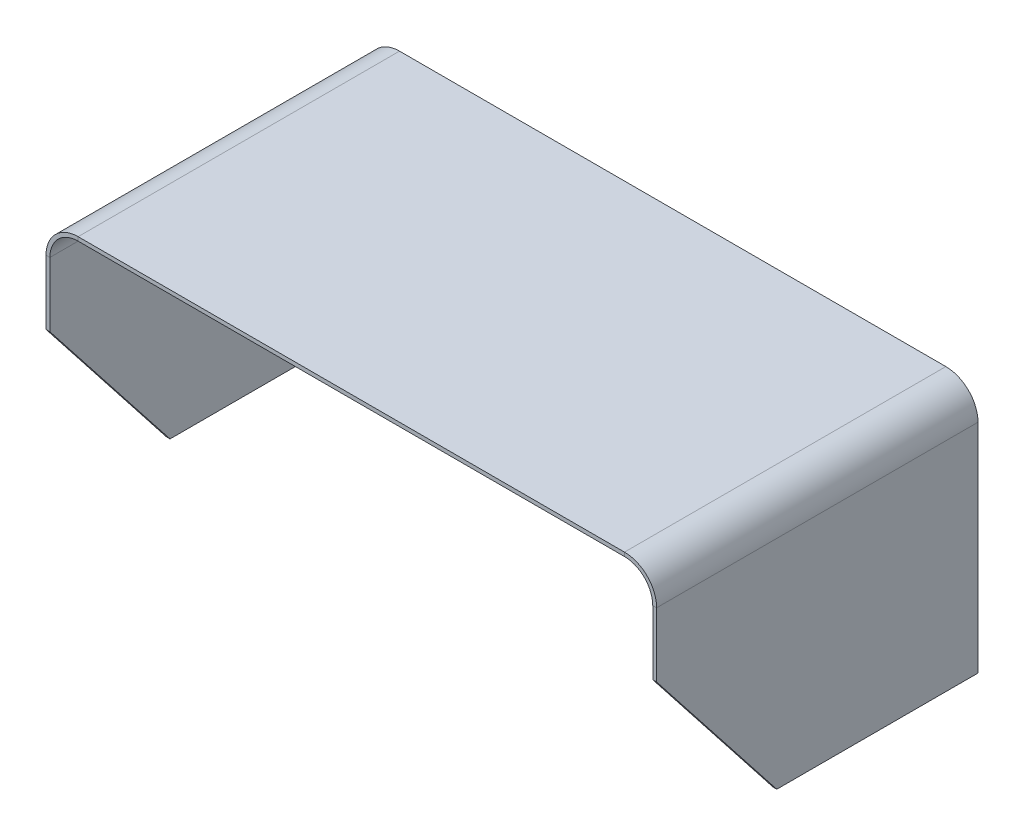
ISO-10303-21;
HEADER;
FILE_DESCRIPTION(('STEP AP214'),'2;1');
FILE_NAME('part.step','',(''),(''),'','','');
FILE_SCHEMA(('AUTOMOTIVE_DESIGN { 1 0 10303 214 1 1 1 1 }'));
ENDSEC;
DATA;
#1=APPLICATION_CONTEXT('core data for automotive mechanical design processes');
#2=APPLICATION_PROTOCOL_DEFINITION('international standard','automotive_design',2000,#1);
#3=PRODUCT_CONTEXT('',#1,'mechanical');
#4=PRODUCT('Part','Part','',(#3));
#5=PRODUCT_RELATED_PRODUCT_CATEGORY('part','',(#4));
#6=PRODUCT_DEFINITION_FORMATION('','',#4);
#7=PRODUCT_DEFINITION_CONTEXT('part definition',#1,'design');
#8=PRODUCT_DEFINITION('design','',#6,#7);
#9=PRODUCT_DEFINITION_SHAPE('','',#8);
#10=(LENGTH_UNIT() NAMED_UNIT(*) SI_UNIT(.MILLI.,.METRE.));
#11=(NAMED_UNIT(*) PLANE_ANGLE_UNIT() SI_UNIT($,.RADIAN.));
#12=(NAMED_UNIT(*) SI_UNIT($,.STERADIAN.) SOLID_ANGLE_UNIT());
#13=UNCERTAINTY_MEASURE_WITH_UNIT(LENGTH_MEASURE(1.E-05),#10,'distance_accuracy_value','');
#14=(GEOMETRIC_REPRESENTATION_CONTEXT(3) GLOBAL_UNCERTAINTY_ASSIGNED_CONTEXT((#13)) GLOBAL_UNIT_ASSIGNED_CONTEXT((#10,
#11,#12)) REPRESENTATION_CONTEXT('',''));
#15=CARTESIAN_POINT('',(0.,0.,0.));
#16=DIRECTION('',(0.,0.,1.));
#17=DIRECTION('',(1.,0.,0.));
#18=AXIS2_PLACEMENT_3D('',#15,#16,#17);
#19=CARTESIAN_POINT('',(53.975,18.288,31.75));
#20=DIRECTION('',(0.,0.,1.));
#21=DIRECTION('',(1.,0.,0.));
#22=AXIS2_PLACEMENT_3D('',#19,#20,#21);
#23=PLANE('',#22);
#24=DIRECTION('',(0.,1.,0.));
#25=VECTOR('',#24,1.);
#26=CARTESIAN_POINT('',(59.563,0.,31.75));
#27=LINE('',#26,#25);
#28=CARTESIAN_POINT('',(59.563,0.,31.75));
#29=VERTEX_POINT('',#28);
#30=CARTESIAN_POINT('',(59.563,12.7,31.75));
#31=VERTEX_POINT('',#30);
#32=EDGE_CURVE('E145',#29,#31,#27,.T.);
#33=ORIENTED_EDGE('',*,*,#32,.F.);
#34=DIRECTION('',(-1.,0.,0.));
#35=VECTOR('',#34,1.);
#36=CARTESIAN_POINT('',(59.563,0.,31.75));
#37=LINE('',#36,#35);
#38=CARTESIAN_POINT('',(60.325,0.,31.75));
#39=VERTEX_POINT('',#38);
#40=EDGE_CURVE('E133',#29,#39,#37,.F.);
#41=ORIENTED_EDGE('',*,*,#40,.T.);
#42=DIRECTION('',(0.,1.,0.));
#43=VECTOR('',#42,1.);
#44=CARTESIAN_POINT('',(60.325,0.,31.75));
#45=LINE('',#44,#43);
#46=CARTESIAN_POINT('',(60.325,12.7,31.75));
#47=VERTEX_POINT('',#46);
#48=EDGE_CURVE('E143',#39,#47,#45,.T.);
#49=ORIENTED_EDGE('',*,*,#48,.T.);
#50=DIRECTION('',(-1.,0.,0.));
#51=VECTOR('',#50,1.);
#52=CARTESIAN_POINT('',(60.325,12.7,31.75));
#53=LINE('',#52,#51);
#54=EDGE_CURVE('E240',#47,#31,#53,.T.);
#55=ORIENTED_EDGE('',*,*,#54,.T.);
#56=EDGE_LOOP('',(#33,#41,#49,#55));
#57=FACE_BOUND('',#56,.T.);
#58=ADVANCED_FACE('F33',(#57),#23,.T.);
#59=CARTESIAN_POINT('',(59.563,0.,31.75));
#60=DIRECTION('',(-1.,0.,0.));
#61=DIRECTION('',(0.,0.,1.));
#62=AXIS2_PLACEMENT_3D('',#59,#60,#61);
#63=PLANE('',#62);
#64=DIRECTION('',(0.,0.,-1.));
#65=VECTOR('',#64,1.);
#66=CARTESIAN_POINT('',(59.563,-30.226,31.75));
#67=LINE('',#66,#65);
#68=CARTESIAN_POINT('',(59.563,-30.226,8.00099999998738));
#69=VERTEX_POINT('',#68);
#70=CARTESIAN_POINT('',(59.563,-30.226,-31.75));
#71=VERTEX_POINT('',#70);
#72=EDGE_CURVE('E216',#69,#71,#67,.T.);
#73=ORIENTED_EDGE('',*,*,#72,.F.);
#74=DIRECTION('',(0.,-0.786318338822263,-0.617821551932106));
#75=VECTOR('',#74,1.);
#76=CARTESIAN_POINT('',(59.563,0.,31.75));
#77=LINE('',#76,#75);
#78=EDGE_CURVE('E138',#29,#69,#77,.T.);
#79=ORIENTED_EDGE('',*,*,#78,.F.);
#80=ORIENTED_EDGE('',*,*,#32,.T.);
#81=DIRECTION('',(0.,0.,-1.));
#82=VECTOR('',#81,1.);
#83=CARTESIAN_POINT('',(59.563,12.7,31.75));
#84=LINE('',#83,#82);
#85=CARTESIAN_POINT('',(59.563,12.7,-31.75));
#86=VERTEX_POINT('',#85);
#87=EDGE_CURVE('E218',#31,#86,#84,.T.);
#88=ORIENTED_EDGE('',*,*,#87,.T.);
#89=DIRECTION('',(0.,1.,0.));
#90=VECTOR('',#89,1.);
#91=CARTESIAN_POINT('',(59.563,0.,-31.75));
#92=LINE('',#91,#90);
#93=EDGE_CURVE('E184',#71,#86,#92,.T.);
#94=ORIENTED_EDGE('',*,*,#93,.F.);
#95=EDGE_LOOP('',(#73,#79,#80,#88,#94));
#96=FACE_BOUND('',#95,.T.);
#97=ADVANCED_FACE('F333',(#96),#63,.T.);
#98=CARTESIAN_POINT('',(60.325,-30.226,31.75));
#99=DIRECTION('',(0.,-1.,0.));
#100=DIRECTION('',(1.,0.,0.));
#101=AXIS2_PLACEMENT_3D('',#98,#99,#100);
#102=PLANE('',#101);
#103=DIRECTION('',(0.,0.,-1.));
#104=VECTOR('',#103,1.);
#105=CARTESIAN_POINT('',(60.325,-30.226,31.75));
#106=LINE('',#105,#104);
#107=CARTESIAN_POINT('',(60.325,-30.226,8.0009999999874));
#108=VERTEX_POINT('',#107);
#109=CARTESIAN_POINT('',(60.325,-30.226,-31.75));
#110=VERTEX_POINT('',#109);
#111=EDGE_CURVE('E214',#108,#110,#106,.T.);
#112=ORIENTED_EDGE('',*,*,#111,.F.);
#113=DIRECTION('',(-1.,0.,0.));
#114=VECTOR('',#113,1.);
#115=CARTESIAN_POINT('',(59.563,-30.226,8.00099999998738));
#116=LINE('',#115,#114);
#117=EDGE_CURVE('E48',#69,#108,#116,.F.);
#118=ORIENTED_EDGE('',*,*,#117,.F.);
#119=ORIENTED_EDGE('',*,*,#72,.T.);
#120=DIRECTION('',(-1.,0.,0.));
#121=VECTOR('',#120,1.);
#122=CARTESIAN_POINT('',(60.325,-30.226,-31.75));
#123=LINE('',#122,#121);
#124=EDGE_CURVE('E187',#110,#71,#123,.T.);
#125=ORIENTED_EDGE('',*,*,#124,.F.);
#126=EDGE_LOOP('',(#112,#118,#119,#125));
#127=FACE_BOUND('',#126,.T.);
#128=ADVANCED_FACE('F338',(#127),#102,.T.);
#129=CARTESIAN_POINT('',(60.325,0.,31.75));
#130=DIRECTION('',(-1.,0.,0.));
#131=DIRECTION('',(0.,-1.,0.));
#132=AXIS2_PLACEMENT_3D('',#129,#130,#131);
#133=PLANE('',#132);
#134=DIRECTION('',(0.,-0.786318338822263,-0.617821551932106));
#135=VECTOR('',#134,1.);
#136=CARTESIAN_POINT('',(60.325,0.,31.75));
#137=LINE('',#136,#135);
#138=EDGE_CURVE('E130',#39,#108,#137,.T.);
#139=ORIENTED_EDGE('',*,*,#138,.T.);
#140=ORIENTED_EDGE('',*,*,#111,.T.);
#141=DIRECTION('',(0.,1.,0.));
#142=VECTOR('',#141,1.);
#143=CARTESIAN_POINT('',(60.325,0.,-31.75));
#144=LINE('',#143,#142);
#145=CARTESIAN_POINT('',(60.325,12.7,-31.75));
#146=VERTEX_POINT('',#145);
#147=EDGE_CURVE('E190',#110,#146,#144,.T.);
#148=ORIENTED_EDGE('',*,*,#147,.T.);
#149=DIRECTION('',(0.,0.,-1.));
#150=VECTOR('',#149,1.);
#151=CARTESIAN_POINT('',(60.325,12.7,31.75));
#152=LINE('',#151,#150);
#153=EDGE_CURVE('E151',#47,#146,#152,.T.);
#154=ORIENTED_EDGE('',*,*,#153,.F.);
#155=ORIENTED_EDGE('',*,*,#48,.F.);
#156=EDGE_LOOP('',(#139,#140,#148,#154,#155));
#157=FACE_BOUND('',#156,.T.);
#158=ADVANCED_FACE('F148',(#157),#133,.F.);
#159=CARTESIAN_POINT('',(-59.563,-30.226,31.75));
#160=DIRECTION('',(0.,-1.,0.));
#161=DIRECTION('',(1.,0.,0.));
#162=AXIS2_PLACEMENT_3D('',#159,#160,#161);
#163=PLANE('',#162);
#164=DIRECTION('',(0.,0.,-1.));
#165=VECTOR('',#164,1.);
#166=CARTESIAN_POINT('',(-59.563,-30.226,31.75));
#167=LINE('',#166,#165);
#168=CARTESIAN_POINT('',(-59.563,-30.226,8.00099999998738));
#169=VERTEX_POINT('',#168);
#170=CARTESIAN_POINT('',(-59.563,-30.226,-31.75));
#171=VERTEX_POINT('',#170);
#172=EDGE_CURVE('E230',#169,#171,#167,.T.);
#173=ORIENTED_EDGE('',*,*,#172,.F.);
#174=DIRECTION('',(1.,0.,0.));
#175=VECTOR('',#174,1.);
#176=CARTESIAN_POINT('',(-59.563,-30.226,8.00099999998738));
#177=LINE('',#176,#175);
#178=CARTESIAN_POINT('',(-60.325,-30.226,8.00099999998738));
#179=VERTEX_POINT('',#178);
#180=EDGE_CURVE('E286',#169,#179,#177,.F.);
#181=ORIENTED_EDGE('',*,*,#180,.T.);
#182=DIRECTION('',(0.,0.,-1.));
#183=VECTOR('',#182,1.);
#184=CARTESIAN_POINT('',(-60.325,-30.226,31.75));
#185=LINE('',#184,#183);
#186=CARTESIAN_POINT('',(-60.325,-30.226,-31.75));
#187=VERTEX_POINT('',#186);
#188=EDGE_CURVE('E232',#179,#187,#185,.T.);
#189=ORIENTED_EDGE('',*,*,#188,.T.);
#190=DIRECTION('',(-1.,0.,0.));
#191=VECTOR('',#190,1.);
#192=CARTESIAN_POINT('',(-59.563,-30.226,-31.75));
#193=LINE('',#192,#191);
#194=EDGE_CURVE('E168',#171,#187,#193,.T.);
#195=ORIENTED_EDGE('',*,*,#194,.F.);
#196=EDGE_LOOP('',(#173,#181,#189,#195));
#197=FACE_BOUND('',#196,.T.);
#198=ADVANCED_FACE('F285',(#197),#163,.T.);
#199=CARTESIAN_POINT('',(-59.563,0.,31.75));
#200=DIRECTION('',(1.,0.,0.));
#201=DIRECTION('',(0.,0.,-1.));
#202=AXIS2_PLACEMENT_3D('',#199,#200,#201);
#203=PLANE('',#202);
#204=DIRECTION('',(0.,1.,0.));
#205=VECTOR('',#204,1.);
#206=CARTESIAN_POINT('',(-59.563,0.,31.75));
#207=LINE('',#206,#205);
#208=CARTESIAN_POINT('',(-59.563,12.7,31.75));
#209=VERTEX_POINT('',#208);
#210=CARTESIAN_POINT('',(-59.563,0.,31.75));
#211=VERTEX_POINT('',#210);
#212=EDGE_CURVE('E251',#209,#211,#207,.F.);
#213=ORIENTED_EDGE('',*,*,#212,.T.);
#214=DIRECTION('',(0.,0.786318338822263,0.617821551932106));
#215=VECTOR('',#214,1.);
#216=CARTESIAN_POINT('',(-59.563,0.,31.75));
#217=LINE('',#216,#215);
#218=EDGE_CURVE('E56',#169,#211,#217,.T.);
#219=ORIENTED_EDGE('',*,*,#218,.F.);
#220=ORIENTED_EDGE('',*,*,#172,.T.);
#221=DIRECTION('',(0.,1.,0.));
#222=VECTOR('',#221,1.);
#223=CARTESIAN_POINT('',(-59.563,0.,-31.75));
#224=LINE('',#223,#222);
#225=CARTESIAN_POINT('',(-59.563,12.7,-31.75));
#226=VERTEX_POINT('',#225);
#227=EDGE_CURVE('E171',#226,#171,#224,.F.);
#228=ORIENTED_EDGE('',*,*,#227,.F.);
#229=DIRECTION('',(0.,0.,-1.));
#230=VECTOR('',#229,1.);
#231=CARTESIAN_POINT('',(-59.563,12.7,31.75));
#232=LINE('',#231,#230);
#233=EDGE_CURVE('E227',#209,#226,#232,.T.);
#234=ORIENTED_EDGE('',*,*,#233,.F.);
#235=EDGE_LOOP('',(#213,#219,#220,#228,#234));
#236=FACE_BOUND('',#235,.T.);
#237=ADVANCED_FACE('F281',(#236),#203,.T.);
#238=CARTESIAN_POINT('',(-60.325,0.,31.75));
#239=DIRECTION('',(1.,0.,0.));
#240=DIRECTION('',(0.,0.,-1.));
#241=AXIS2_PLACEMENT_3D('',#238,#239,#240);
#242=PLANE('',#241);
#243=DIRECTION('',(0.,0.786318338822263,0.617821551932106));
#244=VECTOR('',#243,1.);
#245=CARTESIAN_POINT('',(-60.325,0.,31.75));
#246=LINE('',#245,#244);
#247=CARTESIAN_POINT('',(-60.325,0.,31.75));
#248=VERTEX_POINT('',#247);
#249=EDGE_CURVE('E261',#179,#248,#246,.T.);
#250=ORIENTED_EDGE('',*,*,#249,.T.);
#251=DIRECTION('',(0.,-1.,0.));
#252=VECTOR('',#251,1.);
#253=CARTESIAN_POINT('',(-60.325,0.,31.75));
#254=LINE('',#253,#252);
#255=CARTESIAN_POINT('',(-60.325,12.7,31.75));
#256=VERTEX_POINT('',#255);
#257=EDGE_CURVE('E204',#256,#248,#254,.T.);
#258=ORIENTED_EDGE('',*,*,#257,.F.);
#259=DIRECTION('',(0.,0.,-1.));
#260=VECTOR('',#259,1.);
#261=CARTESIAN_POINT('',(-60.325,12.7,31.75));
#262=LINE('',#261,#260);
#263=CARTESIAN_POINT('',(-60.325,12.7,-31.75));
#264=VERTEX_POINT('',#263);
#265=EDGE_CURVE('E167',#256,#264,#262,.T.);
#266=ORIENTED_EDGE('',*,*,#265,.T.);
#267=DIRECTION('',(0.,-1.,0.));
#268=VECTOR('',#267,1.);
#269=CARTESIAN_POINT('',(-60.325,0.,-31.75));
#270=LINE('',#269,#268);
#271=EDGE_CURVE('E201',#264,#187,#270,.T.);
#272=ORIENTED_EDGE('',*,*,#271,.T.);
#273=ORIENTED_EDGE('',*,*,#188,.F.);
#274=EDGE_LOOP('',(#250,#258,#266,#272,#273));
#275=FACE_BOUND('',#274,.T.);
#276=ADVANCED_FACE('F257',(#275),#242,.F.);
#277=CARTESIAN_POINT('',(-53.975,12.7,31.75));
#278=DIRECTION('',(0.,0.,1.));
#279=DIRECTION('',(1.,0.,0.));
#280=AXIS2_PLACEMENT_3D('',#277,#278,#279);
#281=PLANE('',#280);
#282=ORIENTED_EDGE('',*,*,#257,.T.);
#283=DIRECTION('',(1.,0.,0.));
#284=VECTOR('',#283,1.);
#285=CARTESIAN_POINT('',(-59.563,0.,31.75));
#286=LINE('',#285,#284);
#287=EDGE_CURVE('E172',#211,#248,#286,.F.);
#288=ORIENTED_EDGE('',*,*,#287,.F.);
#289=ORIENTED_EDGE('',*,*,#212,.F.);
#290=DIRECTION('',(-1.,0.,0.));
#291=VECTOR('',#290,1.);
#292=CARTESIAN_POINT('',(-59.563,12.7,31.75));
#293=LINE('',#292,#291);
#294=EDGE_CURVE('E41',#209,#256,#293,.T.);
#295=ORIENTED_EDGE('',*,*,#294,.T.);
#296=EDGE_LOOP('',(#282,#288,#289,#295));
#297=FACE_BOUND('',#296,.T.);
#298=ADVANCED_FACE('F249',(#297),#281,.T.);
#299=CARTESIAN_POINT('',(-53.975,19.05,31.75));
#300=DIRECTION('',(0.,0.,1.));
#301=DIRECTION('',(1.,0.,0.));
#302=AXIS2_PLACEMENT_3D('',#299,#300,#301);
#303=PLANE('',#302);
#304=DIRECTION('',(0.,-1.,0.));
#305=VECTOR('',#304,1.);
#306=CARTESIAN_POINT('',(-53.975,19.05,31.75));
#307=LINE('',#306,#305);
#308=CARTESIAN_POINT('',(-53.975,19.05,31.75));
#309=VERTEX_POINT('',#308);
#310=CARTESIAN_POINT('',(-53.975,18.288,31.75));
#311=VERTEX_POINT('',#310);
#312=EDGE_CURVE('E11',#309,#311,#307,.T.);
#313=ORIENTED_EDGE('',*,*,#312,.F.);
#314=CARTESIAN_POINT('',(-53.975,12.7,31.75));
#315=DIRECTION('',(0.,0.,1.));
#316=DIRECTION('',(-1.,0.,0.));
#317=AXIS2_PLACEMENT_3D('',#314,#315,#316);
#318=CIRCLE('',#317,6.35);
#319=EDGE_CURVE('E164',#309,#256,#318,.T.);
#320=ORIENTED_EDGE('',*,*,#319,.T.);
#321=ORIENTED_EDGE('',*,*,#294,.F.);
#322=CARTESIAN_POINT('',(-53.975,12.7,31.75));
#323=DIRECTION('',(0.,0.,1.));
#324=DIRECTION('',(1.,0.,0.));
#325=AXIS2_PLACEMENT_3D('',#322,#323,#324);
#326=CIRCLE('',#325,5.588);
#327=EDGE_CURVE('E279',#311,#209,#326,.T.);
#328=ORIENTED_EDGE('',*,*,#327,.F.);
#329=EDGE_LOOP('',(#313,#320,#321,#328));
#330=FACE_BOUND('',#329,.T.);
#331=ADVANCED_FACE('F35',(#330),#303,.T.);
#332=CARTESIAN_POINT('',(-59.563,12.7,31.75));
#333=DIRECTION('',(0.,0.,1.));
#334=DIRECTION('',(1.,0.,0.));
#335=AXIS2_PLACEMENT_3D('',#332,#333,#334);
#336=PLANE('',#335);
#337=DIRECTION('',(-1.,0.,0.));
#338=VECTOR('',#337,1.);
#339=CARTESIAN_POINT('',(-53.975,19.05,31.75));
#340=LINE('',#339,#338);
#341=CARTESIAN_POINT('',(53.975,19.05,31.75));
#342=VERTEX_POINT('',#341);
#343=EDGE_CURVE('E156',#342,#309,#340,.T.);
#344=ORIENTED_EDGE('',*,*,#343,.T.);
#345=ORIENTED_EDGE('',*,*,#312,.T.);
#346=DIRECTION('',(-1.,0.,0.));
#347=VECTOR('',#346,1.);
#348=CARTESIAN_POINT('',(-53.975,18.288,31.75));
#349=LINE('',#348,#347);
#350=CARTESIAN_POINT('',(53.975,18.288,31.75));
#351=VERTEX_POINT('',#350);
#352=EDGE_CURVE('E294',#351,#311,#349,.T.);
#353=ORIENTED_EDGE('',*,*,#352,.F.);
#354=DIRECTION('',(0.,1.,0.));
#355=VECTOR('',#354,1.);
#356=CARTESIAN_POINT('',(53.975,18.288,31.75));
#357=LINE('',#356,#355);
#358=EDGE_CURVE('E238',#351,#342,#357,.T.);
#359=ORIENTED_EDGE('',*,*,#358,.T.);
#360=EDGE_LOOP('',(#344,#345,#353,#359));
#361=FACE_BOUND('',#360,.T.);
#362=ADVANCED_FACE('F311',(#361),#336,.T.);
#363=CARTESIAN_POINT('',(-60.325,12.7,-31.75));
#364=DIRECTION('',(0.,0.,-1.));
#365=DIRECTION('',(-1.,0.,0.));
#366=AXIS2_PLACEMENT_3D('',#363,#364,#365);
#367=PLANE('',#366);
#368=DIRECTION('',(1.,0.,0.));
#369=VECTOR('',#368,1.);
#370=CARTESIAN_POINT('',(-60.325,12.7,-31.75));
#371=LINE('',#370,#369);
#372=EDGE_CURVE('E244',#264,#226,#371,.T.);
#373=ORIENTED_EDGE('',*,*,#372,.F.);
#374=CARTESIAN_POINT('',(-53.975,12.7,-31.75));
#375=DIRECTION('',(0.,0.,1.));
#376=DIRECTION('',(-1.,0.,0.));
#377=AXIS2_PLACEMENT_3D('',#374,#375,#376);
#378=CIRCLE('',#377,6.35);
#379=CARTESIAN_POINT('',(-53.975,19.05,-31.75));
#380=VERTEX_POINT('',#379);
#381=EDGE_CURVE('E198',#380,#264,#378,.T.);
#382=ORIENTED_EDGE('',*,*,#381,.F.);
#383=DIRECTION('',(0.,1.,0.));
#384=VECTOR('',#383,1.);
#385=CARTESIAN_POINT('',(-53.975,18.288,-31.75));
#386=LINE('',#385,#384);
#387=CARTESIAN_POINT('',(-53.975,18.288,-31.75));
#388=VERTEX_POINT('',#387);
#389=EDGE_CURVE('E242',#388,#380,#386,.T.);
#390=ORIENTED_EDGE('',*,*,#389,.F.);
#391=CARTESIAN_POINT('',(-53.975,12.7,-31.75));
#392=DIRECTION('',(0.,0.,1.));
#393=DIRECTION('',(1.,0.,0.));
#394=AXIS2_PLACEMENT_3D('',#391,#392,#393);
#395=CIRCLE('',#394,5.588);
#396=EDGE_CURVE('E175',#388,#226,#395,.T.);
#397=ORIENTED_EDGE('',*,*,#396,.T.);
#398=EDGE_LOOP('',(#373,#382,#390,#397));
#399=FACE_BOUND('',#398,.T.);
#400=ADVANCED_FACE('F269',(#399),#367,.T.);
#401=CARTESIAN_POINT('',(-53.975,18.288,-31.75));
#402=DIRECTION('',(0.,0.,-1.));
#403=DIRECTION('',(-1.,0.,0.));
#404=AXIS2_PLACEMENT_3D('',#401,#402,#403);
#405=PLANE('',#404);
#406=ORIENTED_EDGE('',*,*,#271,.F.);
#407=ORIENTED_EDGE('',*,*,#372,.T.);
#408=ORIENTED_EDGE('',*,*,#227,.T.);
#409=ORIENTED_EDGE('',*,*,#194,.T.);
#410=EDGE_LOOP('',(#406,#407,#408,#409));
#411=FACE_BOUND('',#410,.T.);
#412=ADVANCED_FACE('F272',(#411),#405,.T.);
#413=CARTESIAN_POINT('',(60.325,12.7,31.75));
#414=DIRECTION('',(0.,0.,1.));
#415=DIRECTION('',(1.,0.,0.));
#416=AXIS2_PLACEMENT_3D('',#413,#414,#415);
#417=PLANE('',#416);
#418=ORIENTED_EDGE('',*,*,#54,.F.);
#419=CARTESIAN_POINT('',(53.975,12.7,31.75));
#420=DIRECTION('',(0.,0.,1.));
#421=DIRECTION('',(1.,0.,0.));
#422=AXIS2_PLACEMENT_3D('',#419,#420,#421);
#423=CIRCLE('',#422,6.35);
#424=EDGE_CURVE('E153',#47,#342,#423,.T.);
#425=ORIENTED_EDGE('',*,*,#424,.T.);
#426=ORIENTED_EDGE('',*,*,#358,.F.);
#427=CARTESIAN_POINT('',(53.975,12.7,31.75));
#428=DIRECTION('',(0.,0.,1.));
#429=DIRECTION('',(1.,0.,0.));
#430=AXIS2_PLACEMENT_3D('',#427,#428,#429);
#431=CIRCLE('',#430,5.588);
#432=EDGE_CURVE('E158',#31,#351,#431,.T.);
#433=ORIENTED_EDGE('',*,*,#432,.F.);
#434=EDGE_LOOP('',(#418,#425,#426,#433));
#435=FACE_BOUND('',#434,.T.);
#436=ADVANCED_FACE('F305',(#435),#417,.T.);
#437=CARTESIAN_POINT('',(53.975,19.05,-31.75));
#438=DIRECTION('',(0.,0.,-1.));
#439=DIRECTION('',(-1.,0.,0.));
#440=AXIS2_PLACEMENT_3D('',#437,#438,#439);
#441=PLANE('',#440);
#442=DIRECTION('',(0.,-1.,0.));
#443=VECTOR('',#442,1.);
#444=CARTESIAN_POINT('',(53.975,19.05,-31.75));
#445=LINE('',#444,#443);
#446=CARTESIAN_POINT('',(53.975,19.05,-31.75));
#447=VERTEX_POINT('',#446);
#448=CARTESIAN_POINT('',(53.975,18.288,-31.75));
#449=VERTEX_POINT('',#448);
#450=EDGE_CURVE('E236',#447,#449,#445,.T.);
#451=ORIENTED_EDGE('',*,*,#450,.F.);
#452=CARTESIAN_POINT('',(53.975,12.7,-31.75));
#453=DIRECTION('',(0.,0.,1.));
#454=DIRECTION('',(1.,0.,0.));
#455=AXIS2_PLACEMENT_3D('',#452,#453,#454);
#456=CIRCLE('',#455,6.35);
#457=EDGE_CURVE('E192',#146,#447,#456,.T.);
#458=ORIENTED_EDGE('',*,*,#457,.F.);
#459=DIRECTION('',(1.,0.,0.));
#460=VECTOR('',#459,1.);
#461=CARTESIAN_POINT('',(59.563,12.7,-31.75));
#462=LINE('',#461,#460);
#463=EDGE_CURVE('E234',#86,#146,#462,.T.);
#464=ORIENTED_EDGE('',*,*,#463,.F.);
#465=CARTESIAN_POINT('',(53.975,12.7,-31.75));
#466=DIRECTION('',(0.,0.,1.));
#467=DIRECTION('',(1.,0.,0.));
#468=AXIS2_PLACEMENT_3D('',#465,#466,#467);
#469=CIRCLE('',#468,5.588);
#470=EDGE_CURVE('E181',#86,#449,#469,.T.);
#471=ORIENTED_EDGE('',*,*,#470,.T.);
#472=EDGE_LOOP('',(#451,#458,#464,#471));
#473=FACE_BOUND('',#472,.T.);
#474=ADVANCED_FACE('F320',(#473),#441,.T.);
#475=CARTESIAN_POINT('',(59.563,12.7,-31.75));
#476=DIRECTION('',(0.,0.,-1.));
#477=DIRECTION('',(-1.,0.,0.));
#478=AXIS2_PLACEMENT_3D('',#475,#476,#477);
#479=PLANE('',#478);
#480=DIRECTION('',(-1.,0.,0.));
#481=VECTOR('',#480,1.);
#482=CARTESIAN_POINT('',(-53.975,19.05,-31.75));
#483=LINE('',#482,#481);
#484=EDGE_CURVE('E195',#447,#380,#483,.T.);
#485=ORIENTED_EDGE('',*,*,#484,.F.);
#486=ORIENTED_EDGE('',*,*,#450,.T.);
#487=DIRECTION('',(-1.,0.,0.));
#488=VECTOR('',#487,1.);
#489=CARTESIAN_POINT('',(-53.975,18.288,-31.75));
#490=LINE('',#489,#488);
#491=EDGE_CURVE('E178',#449,#388,#490,.T.);
#492=ORIENTED_EDGE('',*,*,#491,.T.);
#493=ORIENTED_EDGE('',*,*,#389,.T.);
#494=EDGE_LOOP('',(#485,#486,#492,#493));
#495=FACE_BOUND('',#494,.T.);
#496=ADVANCED_FACE('F317',(#495),#479,.T.);
#497=CARTESIAN_POINT('',(-53.975,12.7,31.75));
#498=DIRECTION('',(0.,0.,-1.));
#499=DIRECTION('',(-1.,0.,0.));
#500=AXIS2_PLACEMENT_3D('',#497,#498,#499);
#501=CYLINDRICAL_SURFACE('',#500,5.588);
#502=ORIENTED_EDGE('',*,*,#396,.F.);
#503=DIRECTION('',(0.,0.,-1.));
#504=VECTOR('',#503,1.);
#505=CARTESIAN_POINT('',(-53.975,18.288,31.75));
#506=LINE('',#505,#504);
#507=EDGE_CURVE('E224',#311,#388,#506,.T.);
#508=ORIENTED_EDGE('',*,*,#507,.F.);
#509=ORIENTED_EDGE('',*,*,#327,.T.);
#510=ORIENTED_EDGE('',*,*,#233,.T.);
#511=EDGE_LOOP('',(#502,#508,#509,#510));
#512=FACE_BOUND('',#511,.T.);
#513=ADVANCED_FACE('F277',(#512),#501,.F.);
#514=CARTESIAN_POINT('',(-53.975,18.288,31.75));
#515=DIRECTION('',(0.,-1.,0.));
#516=DIRECTION('',(1.,0.,0.));
#517=AXIS2_PLACEMENT_3D('',#514,#515,#516);
#518=PLANE('',#517);
#519=ORIENTED_EDGE('',*,*,#491,.F.);
#520=DIRECTION('',(0.,0.,-1.));
#521=VECTOR('',#520,1.);
#522=CARTESIAN_POINT('',(53.975,18.288,31.75));
#523=LINE('',#522,#521);
#524=EDGE_CURVE('E221',#351,#449,#523,.T.);
#525=ORIENTED_EDGE('',*,*,#524,.F.);
#526=ORIENTED_EDGE('',*,*,#352,.T.);
#527=ORIENTED_EDGE('',*,*,#507,.T.);
#528=EDGE_LOOP('',(#519,#525,#526,#527));
#529=FACE_BOUND('',#528,.T.);
#530=ADVANCED_FACE('F310',(#529),#518,.T.);
#531=CARTESIAN_POINT('',(53.975,12.7,31.75));
#532=DIRECTION('',(0.,0.,-1.));
#533=DIRECTION('',(-1.,0.,0.));
#534=AXIS2_PLACEMENT_3D('',#531,#532,#533);
#535=CYLINDRICAL_SURFACE('',#534,5.588);
#536=ORIENTED_EDGE('',*,*,#470,.F.);
#537=ORIENTED_EDGE('',*,*,#87,.F.);
#538=ORIENTED_EDGE('',*,*,#432,.T.);
#539=ORIENTED_EDGE('',*,*,#524,.T.);
#540=EDGE_LOOP('',(#536,#537,#538,#539));
#541=FACE_BOUND('',#540,.T.);
#542=ADVANCED_FACE('F301',(#541),#535,.F.);
#543=CARTESIAN_POINT('',(53.975,12.7,31.75));
#544=DIRECTION('',(0.,0.,-1.));
#545=DIRECTION('',(-1.,0.,0.));
#546=AXIS2_PLACEMENT_3D('',#543,#544,#545);
#547=CYLINDRICAL_SURFACE('',#546,6.35);
#548=ORIENTED_EDGE('',*,*,#457,.T.);
#549=DIRECTION('',(0.,0.,-1.));
#550=VECTOR('',#549,1.);
#551=CARTESIAN_POINT('',(53.975,19.05,31.75));
#552=LINE('',#551,#550);
#553=EDGE_CURVE('E210',#342,#447,#552,.T.);
#554=ORIENTED_EDGE('',*,*,#553,.F.);
#555=ORIENTED_EDGE('',*,*,#424,.F.);
#556=ORIENTED_EDGE('',*,*,#153,.T.);
#557=EDGE_LOOP('',(#548,#554,#555,#556));
#558=FACE_BOUND('',#557,.T.);
#559=ADVANCED_FACE('F322',(#558),#547,.T.);
#560=CARTESIAN_POINT('',(-53.975,19.05,31.75));
#561=DIRECTION('',(0.,-1.,0.));
#562=DIRECTION('',(1.,0.,0.));
#563=AXIS2_PLACEMENT_3D('',#560,#561,#562);
#564=PLANE('',#563);
#565=ORIENTED_EDGE('',*,*,#484,.T.);
#566=DIRECTION('',(0.,0.,-1.));
#567=VECTOR('',#566,1.);
#568=CARTESIAN_POINT('',(-53.975,19.05,31.75));
#569=LINE('',#568,#567);
#570=EDGE_CURVE('E207',#309,#380,#569,.T.);
#571=ORIENTED_EDGE('',*,*,#570,.F.);
#572=ORIENTED_EDGE('',*,*,#343,.F.);
#573=ORIENTED_EDGE('',*,*,#553,.T.);
#574=EDGE_LOOP('',(#565,#571,#572,#573));
#575=FACE_BOUND('',#574,.T.);
#576=ADVANCED_FACE('F314',(#575),#564,.F.);
#577=CARTESIAN_POINT('',(-53.975,12.7,31.75));
#578=DIRECTION('',(0.,0.,-1.));
#579=DIRECTION('',(-1.,0.,0.));
#580=AXIS2_PLACEMENT_3D('',#577,#578,#579);
#581=CYLINDRICAL_SURFACE('',#580,6.35);
#582=ORIENTED_EDGE('',*,*,#381,.T.);
#583=ORIENTED_EDGE('',*,*,#265,.F.);
#584=ORIENTED_EDGE('',*,*,#319,.F.);
#585=ORIENTED_EDGE('',*,*,#570,.T.);
#586=EDGE_LOOP('',(#582,#583,#584,#585));
#587=FACE_BOUND('',#586,.T.);
#588=ADVANCED_FACE('F265',(#587),#581,.T.);
#589=CARTESIAN_POINT('',(-53.975,12.7,-31.75));
#590=DIRECTION('',(0.,0.,1.));
#591=DIRECTION('',(1.,0.,0.));
#592=AXIS2_PLACEMENT_3D('',#589,#590,#591);
#593=PLANE('',#592);
#594=ORIENTED_EDGE('',*,*,#93,.T.);
#595=ORIENTED_EDGE('',*,*,#463,.T.);
#596=ORIENTED_EDGE('',*,*,#147,.F.);
#597=ORIENTED_EDGE('',*,*,#124,.T.);
#598=EDGE_LOOP('',(#594,#595,#596,#597));
#599=FACE_BOUND('',#598,.T.);
#600=ADVANCED_FACE('F365',(#599),#593,.F.);
#601=CARTESIAN_POINT('',(-59.563,0.,31.75));
#602=DIRECTION('',(0.,0.617821551932106,-0.786318338822263));
#603=DIRECTION('',(0.,0.786318338822263,0.617821551932106));
#604=AXIS2_PLACEMENT_3D('',#601,#602,#603);
#605=PLANE('',#604);
#606=ORIENTED_EDGE('',*,*,#218,.T.);
#607=ORIENTED_EDGE('',*,*,#287,.T.);
#608=ORIENTED_EDGE('',*,*,#249,.F.);
#609=ORIENTED_EDGE('',*,*,#180,.F.);
#610=EDGE_LOOP('',(#606,#607,#608,#609));
#611=FACE_BOUND('',#610,.T.);
#612=ADVANCED_FACE('F363',(#611),#605,.F.);
#613=CARTESIAN_POINT('',(59.563,0.,31.75));
#614=DIRECTION('',(0.,0.617821551932106,-0.786318338822263));
#615=DIRECTION('',(0.,-0.786318338822263,-0.617821551932106));
#616=AXIS2_PLACEMENT_3D('',#613,#614,#615);
#617=PLANE('',#616);
#618=ORIENTED_EDGE('',*,*,#78,.T.);
#619=ORIENTED_EDGE('',*,*,#117,.T.);
#620=ORIENTED_EDGE('',*,*,#138,.F.);
#621=ORIENTED_EDGE('',*,*,#40,.F.);
#622=EDGE_LOOP('',(#618,#619,#620,#621));
#623=FACE_BOUND('',#622,.T.);
#624=ADVANCED_FACE('F132',(#623),#617,.F.);
#625=CLOSED_SHELL('',(#58,#97,#128,#158,#198,#237,#276,#298,#331,#362,#400,#412,#436,#474,#496,
#513,#530,#542,#559,#576,#588,#600,#612,#624));
#626=MANIFOLD_SOLID_BREP('B2',#625);
#627=ADVANCED_BREP_SHAPE_REPRESENTATION('',(#18,#626),#14);
#628=SHAPE_DEFINITION_REPRESENTATION(#9,#627);
ENDSEC;
END-ISO-10303-21;
